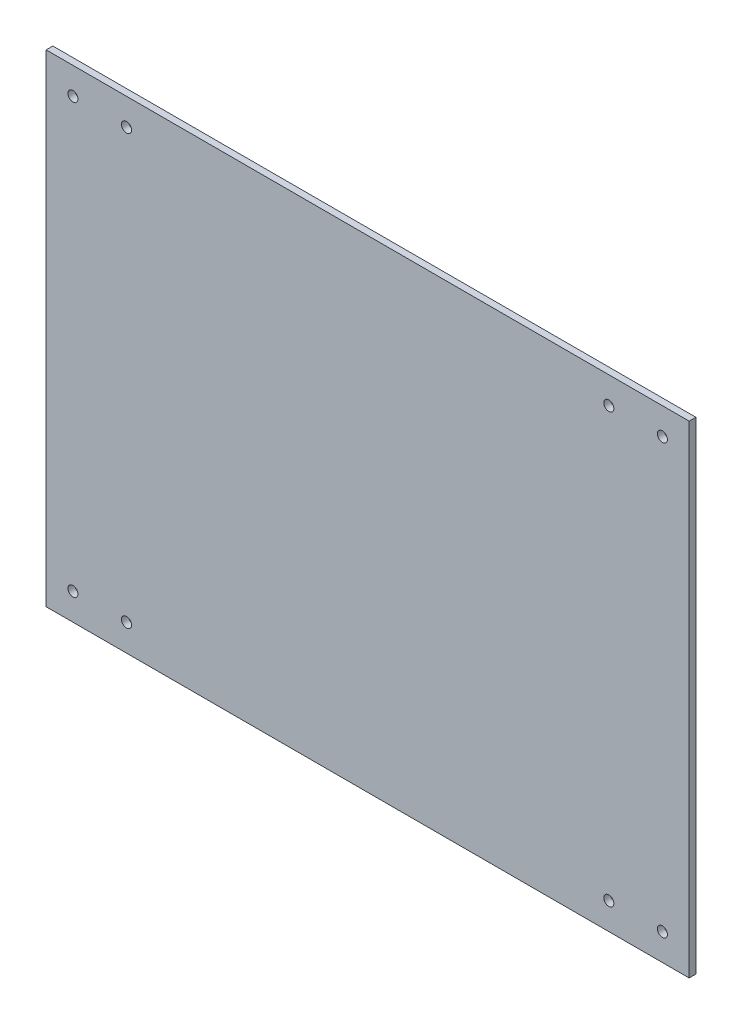
ISO-10303-21;
HEADER;
FILE_DESCRIPTION(('STEP AP214'),'2;1');
FILE_NAME('part.step','',(''),(''),'','','');
FILE_SCHEMA(('AUTOMOTIVE_DESIGN { 1 0 10303 214 1 1 1 1 }'));
ENDSEC;
DATA;
#1=APPLICATION_CONTEXT('core data for automotive mechanical design processes');
#2=APPLICATION_PROTOCOL_DEFINITION('international standard','automotive_design',2000,#1);
#3=PRODUCT_CONTEXT('',#1,'mechanical');
#4=PRODUCT('Part','Part','',(#3));
#5=PRODUCT_RELATED_PRODUCT_CATEGORY('part','',(#4));
#6=PRODUCT_DEFINITION_FORMATION('','',#4);
#7=PRODUCT_DEFINITION_CONTEXT('part definition',#1,'design');
#8=PRODUCT_DEFINITION('design','',#6,#7);
#9=PRODUCT_DEFINITION_SHAPE('','',#8);
#10=(LENGTH_UNIT() NAMED_UNIT(*) SI_UNIT(.MILLI.,.METRE.));
#11=(NAMED_UNIT(*) PLANE_ANGLE_UNIT() SI_UNIT($,.RADIAN.));
#12=(NAMED_UNIT(*) SI_UNIT($,.STERADIAN.) SOLID_ANGLE_UNIT());
#13=UNCERTAINTY_MEASURE_WITH_UNIT(LENGTH_MEASURE(1.E-05),#10,'distance_accuracy_value','');
#14=(GEOMETRIC_REPRESENTATION_CONTEXT(3) GLOBAL_UNCERTAINTY_ASSIGNED_CONTEXT((#13)) GLOBAL_UNIT_ASSIGNED_CONTEXT((#10,
#11,#12)) REPRESENTATION_CONTEXT('',''));
#15=CARTESIAN_POINT('',(0.,0.,0.));
#16=DIRECTION('',(0.,0.,1.));
#17=DIRECTION('',(1.,0.,0.));
#18=AXIS2_PLACEMENT_3D('',#15,#16,#17);
#19=CARTESIAN_POINT('',(0.,0.,3.175));
#20=DIRECTION('',(0.,0.,1.));
#21=DIRECTION('',(1.,0.,0.));
#22=AXIS2_PLACEMENT_3D('',#19,#20,#21);
#23=PLANE('',#22);
#24=CARTESIAN_POINT('',(-114.3,-101.6,3.175));
#25=DIRECTION('',(0.,0.,1.));
#26=DIRECTION('',(1.,0.,0.));
#27=AXIS2_PLACEMENT_3D('',#24,#25,#26);
#28=CIRCLE('',#27,2.38125);
#29=CARTESIAN_POINT('',(-111.91875,-101.6,3.175));
#30=VERTEX_POINT('',#29);
#31=EDGE_CURVE('E146',#30,#30,#28,.T.);
#32=ORIENTED_EDGE('',*,*,#31,.F.);
#33=EDGE_LOOP('',(#32));
#34=FACE_BOUND('',#33,.T.);
#35=CARTESIAN_POINT('',(114.3,101.6,3.175));
#36=DIRECTION('',(0.,0.,1.));
#37=DIRECTION('',(1.,0.,0.));
#38=AXIS2_PLACEMENT_3D('',#35,#36,#37);
#39=CIRCLE('',#38,2.38125);
#40=CARTESIAN_POINT('',(116.68125,101.6,3.175));
#41=VERTEX_POINT('',#40);
#42=EDGE_CURVE('E134',#41,#41,#39,.T.);
#43=ORIENTED_EDGE('',*,*,#42,.F.);
#44=EDGE_LOOP('',(#43));
#45=FACE_BOUND('',#44,.T.);
#46=CARTESIAN_POINT('',(-139.7,-101.6,3.175));
#47=DIRECTION('',(0.,0.,1.));
#48=DIRECTION('',(1.,0.,0.));
#49=AXIS2_PLACEMENT_3D('',#46,#47,#48);
#50=CIRCLE('',#49,2.38125);
#51=CARTESIAN_POINT('',(-137.31875,-101.6,3.175));
#52=VERTEX_POINT('',#51);
#53=EDGE_CURVE('E122',#52,#52,#50,.T.);
#54=ORIENTED_EDGE('',*,*,#53,.F.);
#55=EDGE_LOOP('',(#54));
#56=FACE_BOUND('',#55,.T.);
#57=CARTESIAN_POINT('',(139.7,101.6,3.175));
#58=DIRECTION('',(0.,0.,1.));
#59=DIRECTION('',(1.,0.,0.));
#60=AXIS2_PLACEMENT_3D('',#57,#58,#59);
#61=CIRCLE('',#60,2.38125);
#62=CARTESIAN_POINT('',(142.08125,101.6,3.175));
#63=VERTEX_POINT('',#62);
#64=EDGE_CURVE('E101',#63,#63,#61,.T.);
#65=ORIENTED_EDGE('',*,*,#64,.F.);
#66=EDGE_LOOP('',(#65));
#67=FACE_BOUND('',#66,.T.);
#68=DIRECTION('',(0.,-1.,0.));
#69=VECTOR('',#68,1.);
#70=CARTESIAN_POINT('',(-152.4,-114.3,3.175));
#71=LINE('',#70,#69);
#72=CARTESIAN_POINT('',(-152.4,114.3,3.175));
#73=VERTEX_POINT('',#72);
#74=CARTESIAN_POINT('',(-152.4,-114.3,3.175));
#75=VERTEX_POINT('',#74);
#76=EDGE_CURVE('E86',#73,#75,#71,.T.);
#77=ORIENTED_EDGE('',*,*,#76,.T.);
#78=DIRECTION('',(1.,0.,0.));
#79=VECTOR('',#78,1.);
#80=CARTESIAN_POINT('',(152.4,-114.3,3.175));
#81=LINE('',#80,#79);
#82=CARTESIAN_POINT('',(152.4,-114.3,3.175));
#83=VERTEX_POINT('',#82);
#84=EDGE_CURVE('E81',#75,#83,#81,.T.);
#85=ORIENTED_EDGE('',*,*,#84,.T.);
#86=DIRECTION('',(0.,1.,0.));
#87=VECTOR('',#86,1.);
#88=CARTESIAN_POINT('',(152.4,-114.3,3.175));
#89=LINE('',#88,#87);
#90=CARTESIAN_POINT('',(152.4,114.3,3.175));
#91=VERTEX_POINT('',#90);
#92=EDGE_CURVE('E84',#83,#91,#89,.T.);
#93=ORIENTED_EDGE('',*,*,#92,.T.);
#94=DIRECTION('',(-1.,0.,0.));
#95=VECTOR('',#94,1.);
#96=CARTESIAN_POINT('',(152.4,114.3,3.175));
#97=LINE('',#96,#95);
#98=EDGE_CURVE('E51',#91,#73,#97,.T.);
#99=ORIENTED_EDGE('',*,*,#98,.T.);
#100=EDGE_LOOP('',(#77,#85,#93,#99));
#101=FACE_BOUND('',#100,.T.);
#102=CARTESIAN_POINT('',(-139.7,101.6,3.175));
#103=DIRECTION('',(0.,0.,1.));
#104=DIRECTION('',(1.,0.,0.));
#105=AXIS2_PLACEMENT_3D('',#102,#103,#104);
#106=CIRCLE('',#105,2.38125);
#107=CARTESIAN_POINT('',(-137.31875,101.6,3.175));
#108=VERTEX_POINT('',#107);
#109=EDGE_CURVE('E116',#108,#108,#106,.T.);
#110=ORIENTED_EDGE('',*,*,#109,.F.);
#111=EDGE_LOOP('',(#110));
#112=FACE_BOUND('',#111,.T.);
#113=CARTESIAN_POINT('',(139.7,-101.6,3.175));
#114=DIRECTION('',(0.,0.,1.));
#115=DIRECTION('',(1.,0.,0.));
#116=AXIS2_PLACEMENT_3D('',#113,#114,#115);
#117=CIRCLE('',#116,2.38125);
#118=CARTESIAN_POINT('',(142.08125,-101.6,3.175));
#119=VERTEX_POINT('',#118);
#120=EDGE_CURVE('E128',#119,#119,#117,.T.);
#121=ORIENTED_EDGE('',*,*,#120,.F.);
#122=EDGE_LOOP('',(#121));
#123=FACE_BOUND('',#122,.T.);
#124=CARTESIAN_POINT('',(-114.3,101.6,3.175));
#125=DIRECTION('',(0.,0.,1.));
#126=DIRECTION('',(1.,0.,0.));
#127=AXIS2_PLACEMENT_3D('',#124,#125,#126);
#128=CIRCLE('',#127,2.38125);
#129=CARTESIAN_POINT('',(-111.91875,101.6,3.175));
#130=VERTEX_POINT('',#129);
#131=EDGE_CURVE('E140',#130,#130,#128,.T.);
#132=ORIENTED_EDGE('',*,*,#131,.F.);
#133=EDGE_LOOP('',(#132));
#134=FACE_BOUND('',#133,.T.);
#135=CARTESIAN_POINT('',(114.3,-101.6,3.175));
#136=DIRECTION('',(0.,0.,1.));
#137=DIRECTION('',(1.,0.,0.));
#138=AXIS2_PLACEMENT_3D('',#135,#136,#137);
#139=CIRCLE('',#138,2.38125);
#140=CARTESIAN_POINT('',(116.68125,-101.6,3.175));
#141=VERTEX_POINT('',#140);
#142=EDGE_CURVE('E152',#141,#141,#139,.T.);
#143=ORIENTED_EDGE('',*,*,#142,.F.);
#144=EDGE_LOOP('',(#143));
#145=FACE_BOUND('',#144,.T.);
#146=ADVANCED_FACE('F34',(#34,#45,#56,#67,#101,#112,#123,#134,#145),#23,.T.);
#147=CARTESIAN_POINT('',(0.,0.,0.));
#148=DIRECTION('',(0.,0.,1.));
#149=DIRECTION('',(1.,0.,0.));
#150=AXIS2_PLACEMENT_3D('',#147,#148,#149);
#151=PLANE('',#150);
#152=DIRECTION('',(0.,-1.,0.));
#153=VECTOR('',#152,1.);
#154=CARTESIAN_POINT('',(-152.4,-114.3,0.));
#155=LINE('',#154,#153);
#156=CARTESIAN_POINT('',(-152.4,114.3,0.));
#157=VERTEX_POINT('',#156);
#158=CARTESIAN_POINT('',(-152.4,-114.3,0.));
#159=VERTEX_POINT('',#158);
#160=EDGE_CURVE('E98',#157,#159,#155,.T.);
#161=ORIENTED_EDGE('',*,*,#160,.F.);
#162=DIRECTION('',(-1.,0.,0.));
#163=VECTOR('',#162,1.);
#164=CARTESIAN_POINT('',(152.4,114.3,0.));
#165=LINE('',#164,#163);
#166=CARTESIAN_POINT('',(152.4,114.3,0.));
#167=VERTEX_POINT('',#166);
#168=EDGE_CURVE('E74',#167,#157,#165,.T.);
#169=ORIENTED_EDGE('',*,*,#168,.F.);
#170=DIRECTION('',(0.,1.,0.));
#171=VECTOR('',#170,1.);
#172=CARTESIAN_POINT('',(152.4,-114.3,0.));
#173=LINE('',#172,#171);
#174=CARTESIAN_POINT('',(152.4,-114.3,0.));
#175=VERTEX_POINT('',#174);
#176=EDGE_CURVE('E68',#175,#167,#173,.T.);
#177=ORIENTED_EDGE('',*,*,#176,.F.);
#178=DIRECTION('',(1.,0.,0.));
#179=VECTOR('',#178,1.);
#180=CARTESIAN_POINT('',(152.4,-114.3,0.));
#181=LINE('',#180,#179);
#182=EDGE_CURVE('E90',#159,#175,#181,.T.);
#183=ORIENTED_EDGE('',*,*,#182,.F.);
#184=EDGE_LOOP('',(#161,#169,#177,#183));
#185=FACE_BOUND('',#184,.T.);
#186=CARTESIAN_POINT('',(139.7,101.6,0.));
#187=DIRECTION('',(0.,0.,1.));
#188=DIRECTION('',(1.,0.,0.));
#189=AXIS2_PLACEMENT_3D('',#186,#187,#188);
#190=CIRCLE('',#189,2.38125);
#191=CARTESIAN_POINT('',(142.08125,101.6,0.));
#192=VERTEX_POINT('',#191);
#193=EDGE_CURVE('E113',#192,#192,#190,.T.);
#194=ORIENTED_EDGE('',*,*,#193,.T.);
#195=EDGE_LOOP('',(#194));
#196=FACE_BOUND('',#195,.T.);
#197=CARTESIAN_POINT('',(-139.7,101.6,0.));
#198=DIRECTION('',(0.,0.,1.));
#199=DIRECTION('',(1.,0.,0.));
#200=AXIS2_PLACEMENT_3D('',#197,#198,#199);
#201=CIRCLE('',#200,2.38125);
#202=CARTESIAN_POINT('',(-137.31875,101.6,0.));
#203=VERTEX_POINT('',#202);
#204=EDGE_CURVE('E119',#203,#203,#201,.T.);
#205=ORIENTED_EDGE('',*,*,#204,.T.);
#206=EDGE_LOOP('',(#205));
#207=FACE_BOUND('',#206,.T.);
#208=CARTESIAN_POINT('',(-139.7,-101.6,0.));
#209=DIRECTION('',(0.,0.,1.));
#210=DIRECTION('',(1.,0.,0.));
#211=AXIS2_PLACEMENT_3D('',#208,#209,#210);
#212=CIRCLE('',#211,2.38125);
#213=CARTESIAN_POINT('',(-137.31875,-101.6,0.));
#214=VERTEX_POINT('',#213);
#215=EDGE_CURVE('E125',#214,#214,#212,.T.);
#216=ORIENTED_EDGE('',*,*,#215,.T.);
#217=EDGE_LOOP('',(#216));
#218=FACE_BOUND('',#217,.T.);
#219=CARTESIAN_POINT('',(139.7,-101.6,0.));
#220=DIRECTION('',(0.,0.,1.));
#221=DIRECTION('',(1.,0.,0.));
#222=AXIS2_PLACEMENT_3D('',#219,#220,#221);
#223=CIRCLE('',#222,2.38125);
#224=CARTESIAN_POINT('',(142.08125,-101.6,0.));
#225=VERTEX_POINT('',#224);
#226=EDGE_CURVE('E131',#225,#225,#223,.T.);
#227=ORIENTED_EDGE('',*,*,#226,.T.);
#228=EDGE_LOOP('',(#227));
#229=FACE_BOUND('',#228,.T.);
#230=CARTESIAN_POINT('',(114.3,101.6,0.));
#231=DIRECTION('',(0.,0.,1.));
#232=DIRECTION('',(1.,0.,0.));
#233=AXIS2_PLACEMENT_3D('',#230,#231,#232);
#234=CIRCLE('',#233,2.38125);
#235=CARTESIAN_POINT('',(116.68125,101.6,0.));
#236=VERTEX_POINT('',#235);
#237=EDGE_CURVE('E137',#236,#236,#234,.T.);
#238=ORIENTED_EDGE('',*,*,#237,.T.);
#239=EDGE_LOOP('',(#238));
#240=FACE_BOUND('',#239,.T.);
#241=CARTESIAN_POINT('',(-114.3,101.6,0.));
#242=DIRECTION('',(0.,0.,1.));
#243=DIRECTION('',(1.,0.,0.));
#244=AXIS2_PLACEMENT_3D('',#241,#242,#243);
#245=CIRCLE('',#244,2.38125);
#246=CARTESIAN_POINT('',(-111.91875,101.6,0.));
#247=VERTEX_POINT('',#246);
#248=EDGE_CURVE('E143',#247,#247,#245,.T.);
#249=ORIENTED_EDGE('',*,*,#248,.T.);
#250=EDGE_LOOP('',(#249));
#251=FACE_BOUND('',#250,.T.);
#252=CARTESIAN_POINT('',(-114.3,-101.6,0.));
#253=DIRECTION('',(0.,0.,1.));
#254=DIRECTION('',(1.,0.,0.));
#255=AXIS2_PLACEMENT_3D('',#252,#253,#254);
#256=CIRCLE('',#255,2.38125);
#257=CARTESIAN_POINT('',(-111.91875,-101.6,0.));
#258=VERTEX_POINT('',#257);
#259=EDGE_CURVE('E149',#258,#258,#256,.T.);
#260=ORIENTED_EDGE('',*,*,#259,.T.);
#261=EDGE_LOOP('',(#260));
#262=FACE_BOUND('',#261,.T.);
#263=CARTESIAN_POINT('',(114.3,-101.6,0.));
#264=DIRECTION('',(0.,0.,1.));
#265=DIRECTION('',(1.,0.,0.));
#266=AXIS2_PLACEMENT_3D('',#263,#264,#265);
#267=CIRCLE('',#266,2.38125);
#268=CARTESIAN_POINT('',(116.68125,-101.6,0.));
#269=VERTEX_POINT('',#268);
#270=EDGE_CURVE('E155',#269,#269,#267,.T.);
#271=ORIENTED_EDGE('',*,*,#270,.T.);
#272=EDGE_LOOP('',(#271));
#273=FACE_BOUND('',#272,.T.);
#274=ADVANCED_FACE('F109',(#185,#196,#207,#218,#229,#240,#251,#262,#273),#151,.F.);
#275=CARTESIAN_POINT('',(-152.4,-114.3,3.175));
#276=DIRECTION('',(1.,0.,0.));
#277=DIRECTION('',(0.,0.,-1.));
#278=AXIS2_PLACEMENT_3D('',#275,#276,#277);
#279=PLANE('',#278);
#280=ORIENTED_EDGE('',*,*,#160,.T.);
#281=DIRECTION('',(0.,0.,-1.));
#282=VECTOR('',#281,1.);
#283=CARTESIAN_POINT('',(-152.4,-114.3,3.175));
#284=LINE('',#283,#282);
#285=EDGE_CURVE('E11',#75,#159,#284,.T.);
#286=ORIENTED_EDGE('',*,*,#285,.F.);
#287=ORIENTED_EDGE('',*,*,#76,.F.);
#288=DIRECTION('',(0.,0.,-1.));
#289=VECTOR('',#288,1.);
#290=CARTESIAN_POINT('',(-152.4,114.3,3.175));
#291=LINE('',#290,#289);
#292=EDGE_CURVE('E94',#73,#157,#291,.T.);
#293=ORIENTED_EDGE('',*,*,#292,.T.);
#294=EDGE_LOOP('',(#280,#286,#287,#293));
#295=FACE_BOUND('',#294,.T.);
#296=ADVANCED_FACE('F36',(#295),#279,.F.);
#297=CARTESIAN_POINT('',(152.4,-114.3,3.175));
#298=DIRECTION('',(0.,1.,0.));
#299=DIRECTION('',(-1.,0.,0.));
#300=AXIS2_PLACEMENT_3D('',#297,#298,#299);
#301=PLANE('',#300);
#302=ORIENTED_EDGE('',*,*,#182,.T.);
#303=DIRECTION('',(0.,0.,-1.));
#304=VECTOR('',#303,1.);
#305=CARTESIAN_POINT('',(152.4,-114.3,3.175));
#306=LINE('',#305,#304);
#307=EDGE_CURVE('E43',#83,#175,#306,.T.);
#308=ORIENTED_EDGE('',*,*,#307,.F.);
#309=ORIENTED_EDGE('',*,*,#84,.F.);
#310=ORIENTED_EDGE('',*,*,#285,.T.);
#311=EDGE_LOOP('',(#302,#308,#309,#310));
#312=FACE_BOUND('',#311,.T.);
#313=ADVANCED_FACE('F89',(#312),#301,.F.);
#314=CARTESIAN_POINT('',(152.4,-114.3,3.175));
#315=DIRECTION('',(-1.,0.,0.));
#316=DIRECTION('',(0.,0.,1.));
#317=AXIS2_PLACEMENT_3D('',#314,#315,#316);
#318=PLANE('',#317);
#319=ORIENTED_EDGE('',*,*,#176,.T.);
#320=DIRECTION('',(0.,0.,-1.));
#321=VECTOR('',#320,1.);
#322=CARTESIAN_POINT('',(152.4,114.3,3.175));
#323=LINE('',#322,#321);
#324=EDGE_CURVE('E91',#91,#167,#323,.T.);
#325=ORIENTED_EDGE('',*,*,#324,.F.);
#326=ORIENTED_EDGE('',*,*,#92,.F.);
#327=ORIENTED_EDGE('',*,*,#307,.T.);
#328=EDGE_LOOP('',(#319,#325,#326,#327));
#329=FACE_BOUND('',#328,.T.);
#330=ADVANCED_FACE('F92',(#329),#318,.F.);
#331=CARTESIAN_POINT('',(152.4,114.3,3.175));
#332=DIRECTION('',(0.,-1.,0.));
#333=DIRECTION('',(1.,0.,0.));
#334=AXIS2_PLACEMENT_3D('',#331,#332,#333);
#335=PLANE('',#334);
#336=ORIENTED_EDGE('',*,*,#168,.T.);
#337=ORIENTED_EDGE('',*,*,#292,.F.);
#338=ORIENTED_EDGE('',*,*,#98,.F.);
#339=ORIENTED_EDGE('',*,*,#324,.T.);
#340=EDGE_LOOP('',(#336,#337,#338,#339));
#341=FACE_BOUND('',#340,.T.);
#342=ADVANCED_FACE('F106',(#341),#335,.F.);
#343=CARTESIAN_POINT('',(139.7,101.6,3.175));
#344=DIRECTION('',(0.,0.,-1.));
#345=DIRECTION('',(-1.,0.,0.));
#346=AXIS2_PLACEMENT_3D('',#343,#344,#345);
#347=CYLINDRICAL_SURFACE('',#346,2.38125);
#348=ORIENTED_EDGE('',*,*,#64,.T.);
#349=EDGE_LOOP('',(#348));
#350=FACE_BOUND('',#349,.T.);
#351=ORIENTED_EDGE('',*,*,#193,.F.);
#352=EDGE_LOOP('',(#351));
#353=FACE_BOUND('',#352,.T.);
#354=ADVANCED_FACE('F174',(#350,#353),#347,.F.);
#355=CARTESIAN_POINT('',(-139.7,101.6,3.175));
#356=DIRECTION('',(0.,0.,-1.));
#357=DIRECTION('',(-1.,0.,0.));
#358=AXIS2_PLACEMENT_3D('',#355,#356,#357);
#359=CYLINDRICAL_SURFACE('',#358,2.38125);
#360=ORIENTED_EDGE('',*,*,#109,.T.);
#361=EDGE_LOOP('',(#360));
#362=FACE_BOUND('',#361,.T.);
#363=ORIENTED_EDGE('',*,*,#204,.F.);
#364=EDGE_LOOP('',(#363));
#365=FACE_BOUND('',#364,.T.);
#366=ADVANCED_FACE('F220',(#362,#365),#359,.F.);
#367=CARTESIAN_POINT('',(-139.7,-101.6,3.175));
#368=DIRECTION('',(0.,0.,-1.));
#369=DIRECTION('',(-1.,0.,0.));
#370=AXIS2_PLACEMENT_3D('',#367,#368,#369);
#371=CYLINDRICAL_SURFACE('',#370,2.38125);
#372=ORIENTED_EDGE('',*,*,#53,.T.);
#373=EDGE_LOOP('',(#372));
#374=FACE_BOUND('',#373,.T.);
#375=ORIENTED_EDGE('',*,*,#215,.F.);
#376=EDGE_LOOP('',(#375));
#377=FACE_BOUND('',#376,.T.);
#378=ADVANCED_FACE('F228',(#374,#377),#371,.F.);
#379=CARTESIAN_POINT('',(139.7,-101.6,3.175));
#380=DIRECTION('',(0.,0.,-1.));
#381=DIRECTION('',(-1.,0.,0.));
#382=AXIS2_PLACEMENT_3D('',#379,#380,#381);
#383=CYLINDRICAL_SURFACE('',#382,2.38125);
#384=ORIENTED_EDGE('',*,*,#120,.T.);
#385=EDGE_LOOP('',(#384));
#386=FACE_BOUND('',#385,.T.);
#387=ORIENTED_EDGE('',*,*,#226,.F.);
#388=EDGE_LOOP('',(#387));
#389=FACE_BOUND('',#388,.T.);
#390=ADVANCED_FACE('F236',(#386,#389),#383,.F.);
#391=CARTESIAN_POINT('',(114.3,101.6,3.175));
#392=DIRECTION('',(0.,0.,-1.));
#393=DIRECTION('',(-1.,0.,0.));
#394=AXIS2_PLACEMENT_3D('',#391,#392,#393);
#395=CYLINDRICAL_SURFACE('',#394,2.38125);
#396=ORIENTED_EDGE('',*,*,#42,.T.);
#397=EDGE_LOOP('',(#396));
#398=FACE_BOUND('',#397,.T.);
#399=ORIENTED_EDGE('',*,*,#237,.F.);
#400=EDGE_LOOP('',(#399));
#401=FACE_BOUND('',#400,.T.);
#402=ADVANCED_FACE('F245',(#398,#401),#395,.F.);
#403=CARTESIAN_POINT('',(-114.3,101.6,3.175));
#404=DIRECTION('',(0.,0.,-1.));
#405=DIRECTION('',(-1.,0.,0.));
#406=AXIS2_PLACEMENT_3D('',#403,#404,#405);
#407=CYLINDRICAL_SURFACE('',#406,2.38125);
#408=ORIENTED_EDGE('',*,*,#131,.T.);
#409=EDGE_LOOP('',(#408));
#410=FACE_BOUND('',#409,.T.);
#411=ORIENTED_EDGE('',*,*,#248,.F.);
#412=EDGE_LOOP('',(#411));
#413=FACE_BOUND('',#412,.T.);
#414=ADVANCED_FACE('F254',(#410,#413),#407,.F.);
#415=CARTESIAN_POINT('',(-114.3,-101.6,3.175));
#416=DIRECTION('',(0.,0.,-1.));
#417=DIRECTION('',(-1.,0.,0.));
#418=AXIS2_PLACEMENT_3D('',#415,#416,#417);
#419=CYLINDRICAL_SURFACE('',#418,2.38125);
#420=ORIENTED_EDGE('',*,*,#31,.T.);
#421=EDGE_LOOP('',(#420));
#422=FACE_BOUND('',#421,.T.);
#423=ORIENTED_EDGE('',*,*,#259,.F.);
#424=EDGE_LOOP('',(#423));
#425=FACE_BOUND('',#424,.T.);
#426=ADVANCED_FACE('F263',(#422,#425),#419,.F.);
#427=CARTESIAN_POINT('',(114.3,-101.6,3.175));
#428=DIRECTION('',(0.,0.,-1.));
#429=DIRECTION('',(-1.,0.,0.));
#430=AXIS2_PLACEMENT_3D('',#427,#428,#429);
#431=CYLINDRICAL_SURFACE('',#430,2.38125);
#432=ORIENTED_EDGE('',*,*,#142,.T.);
#433=EDGE_LOOP('',(#432));
#434=FACE_BOUND('',#433,.T.);
#435=ORIENTED_EDGE('',*,*,#270,.F.);
#436=EDGE_LOOP('',(#435));
#437=FACE_BOUND('',#436,.T.);
#438=ADVANCED_FACE('F161',(#434,#437),#431,.F.);
#439=CLOSED_SHELL('',(#146,#274,#296,#313,#330,#342,#354,#366,#378,#390,#402,#414,#426,#438));
#440=MANIFOLD_SOLID_BREP('B2',#439);
#441=ADVANCED_BREP_SHAPE_REPRESENTATION('',(#18,#440),#14);
#442=SHAPE_DEFINITION_REPRESENTATION(#9,#441);
ENDSEC;
END-ISO-10303-21;
